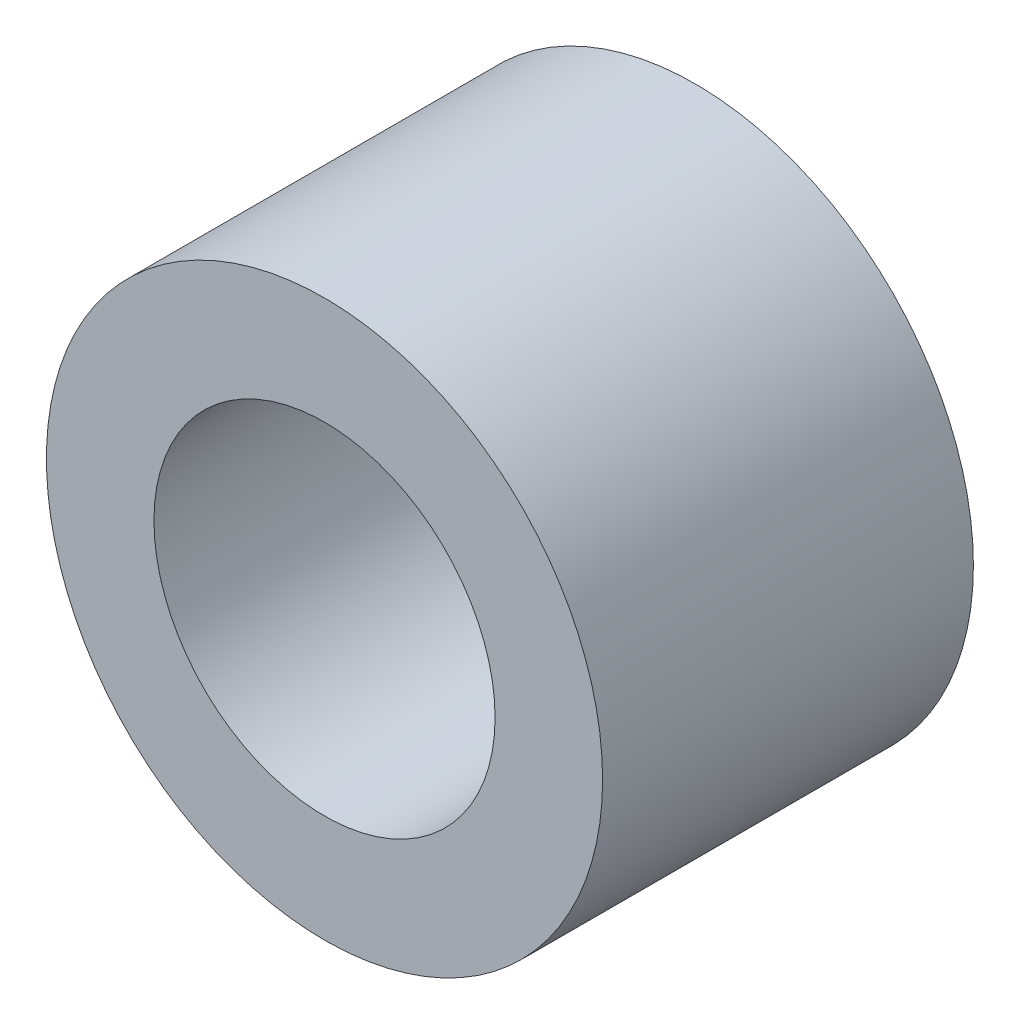
ISO-10303-21;
HEADER;
FILE_DESCRIPTION(('STEP AP214'),'2;1');
FILE_NAME('part.step','',(''),(''),'','','');
FILE_SCHEMA(('AUTOMOTIVE_DESIGN { 1 0 10303 214 1 1 1 1 }'));
ENDSEC;
DATA;
#1=APPLICATION_CONTEXT('core data for automotive mechanical design processes');
#2=APPLICATION_PROTOCOL_DEFINITION('international standard','automotive_design',2000,#1);
#3=PRODUCT_CONTEXT('',#1,'mechanical');
#4=PRODUCT('Part','Part','',(#3));
#5=PRODUCT_RELATED_PRODUCT_CATEGORY('part','',(#4));
#6=PRODUCT_DEFINITION_FORMATION('','',#4);
#7=PRODUCT_DEFINITION_CONTEXT('part definition',#1,'design');
#8=PRODUCT_DEFINITION('design','',#6,#7);
#9=PRODUCT_DEFINITION_SHAPE('','',#8);
#10=(LENGTH_UNIT() NAMED_UNIT(*) SI_UNIT(.MILLI.,.METRE.));
#11=(NAMED_UNIT(*) PLANE_ANGLE_UNIT() SI_UNIT($,.RADIAN.));
#12=(NAMED_UNIT(*) SI_UNIT($,.STERADIAN.) SOLID_ANGLE_UNIT());
#13=UNCERTAINTY_MEASURE_WITH_UNIT(LENGTH_MEASURE(1.E-05),#10,'distance_accuracy_value','');
#14=(GEOMETRIC_REPRESENTATION_CONTEXT(3) GLOBAL_UNCERTAINTY_ASSIGNED_CONTEXT((#13)) GLOBAL_UNIT_ASSIGNED_CONTEXT((#10,
#11,#12)) REPRESENTATION_CONTEXT('',''));
#15=CARTESIAN_POINT('',(0.,0.,0.));
#16=DIRECTION('',(0.,0.,1.));
#17=DIRECTION('',(1.,0.,0.));
#18=AXIS2_PLACEMENT_3D('',#15,#16,#17);
#19=CARTESIAN_POINT('',(0.,0.,3.175));
#20=DIRECTION('',(0.,0.,1.));
#21=DIRECTION('',(1.,0.,0.));
#22=AXIS2_PLACEMENT_3D('',#19,#20,#21);
#23=PLANE('',#22);
#24=CARTESIAN_POINT('',(0.,0.,3.175));
#25=DIRECTION('',(0.,0.,1.));
#26=DIRECTION('',(1.,0.,0.));
#27=AXIS2_PLACEMENT_3D('',#24,#25,#26);
#28=CIRCLE('',#27,2.38125);
#29=CARTESIAN_POINT('',(2.38125,0.,3.175));
#30=VERTEX_POINT('',#29);
#31=EDGE_CURVE('E10',#30,#30,#28,.T.);
#32=ORIENTED_EDGE('',*,*,#31,.T.);
#33=EDGE_LOOP('',(#32));
#34=FACE_BOUND('',#33,.T.);
#35=CARTESIAN_POINT('',(0.,0.,3.175));
#36=DIRECTION('',(0.,0.,1.));
#37=DIRECTION('',(1.,0.,0.));
#38=AXIS2_PLACEMENT_3D('',#35,#36,#37);
#39=CIRCLE('',#38,1.4605);
#40=CARTESIAN_POINT('',(1.4605,0.,3.175));
#41=VERTEX_POINT('',#40);
#42=EDGE_CURVE('E50',#41,#41,#39,.T.);
#43=ORIENTED_EDGE('',*,*,#42,.F.);
#44=EDGE_LOOP('',(#43));
#45=FACE_BOUND('',#44,.T.);
#46=ADVANCED_FACE('F37',(#34,#45),#23,.T.);
#47=CARTESIAN_POINT('',(0.,0.,0.));
#48=DIRECTION('',(0.,0.,1.));
#49=DIRECTION('',(1.,0.,0.));
#50=AXIS2_PLACEMENT_3D('',#47,#48,#49);
#51=PLANE('',#50);
#52=CARTESIAN_POINT('',(0.,0.,0.));
#53=DIRECTION('',(0.,0.,1.));
#54=DIRECTION('',(1.,0.,0.));
#55=AXIS2_PLACEMENT_3D('',#52,#53,#54);
#56=CIRCLE('',#55,2.38125);
#57=CARTESIAN_POINT('',(2.38125,0.,0.));
#58=VERTEX_POINT('',#57);
#59=EDGE_CURVE('E41',#58,#58,#56,.T.);
#60=ORIENTED_EDGE('',*,*,#59,.F.);
#61=EDGE_LOOP('',(#60));
#62=FACE_BOUND('',#61,.T.);
#63=CARTESIAN_POINT('',(0.,0.,0.));
#64=DIRECTION('',(0.,0.,1.));
#65=DIRECTION('',(1.,0.,0.));
#66=AXIS2_PLACEMENT_3D('',#63,#64,#65);
#67=CIRCLE('',#66,1.4605);
#68=CARTESIAN_POINT('',(1.4605,0.,0.));
#69=VERTEX_POINT('',#68);
#70=EDGE_CURVE('E52',#69,#69,#67,.T.);
#71=ORIENTED_EDGE('',*,*,#70,.T.);
#72=EDGE_LOOP('',(#71));
#73=FACE_BOUND('',#72,.T.);
#74=ADVANCED_FACE('F64',(#62,#73),#51,.F.);
#75=CARTESIAN_POINT('',(0.,0.,3.175));
#76=DIRECTION('',(0.,0.,-1.));
#77=DIRECTION('',(-1.,0.,0.));
#78=AXIS2_PLACEMENT_3D('',#75,#76,#77);
#79=CYLINDRICAL_SURFACE('',#78,2.38125);
#80=ORIENTED_EDGE('',*,*,#31,.F.);
#81=EDGE_LOOP('',(#80));
#82=FACE_BOUND('',#81,.T.);
#83=ORIENTED_EDGE('',*,*,#59,.T.);
#84=EDGE_LOOP('',(#83));
#85=FACE_BOUND('',#84,.T.);
#86=ADVANCED_FACE('F39',(#82,#85),#79,.T.);
#87=CARTESIAN_POINT('',(0.,0.,3.175));
#88=DIRECTION('',(0.,0.,-1.));
#89=DIRECTION('',(-1.,0.,0.));
#90=AXIS2_PLACEMENT_3D('',#87,#88,#89);
#91=CYLINDRICAL_SURFACE('',#90,1.4605);
#92=ORIENTED_EDGE('',*,*,#42,.T.);
#93=EDGE_LOOP('',(#92));
#94=FACE_BOUND('',#93,.T.);
#95=ORIENTED_EDGE('',*,*,#70,.F.);
#96=EDGE_LOOP('',(#95));
#97=FACE_BOUND('',#96,.T.);
#98=ADVANCED_FACE('F60',(#94,#97),#91,.F.);
#99=CLOSED_SHELL('',(#46,#74,#86,#98));
#100=MANIFOLD_SOLID_BREP('B2',#99);
#101=ADVANCED_BREP_SHAPE_REPRESENTATION('',(#18,#100),#14);
#102=SHAPE_DEFINITION_REPRESENTATION(#9,#101);
ENDSEC;
END-ISO-10303-21;
